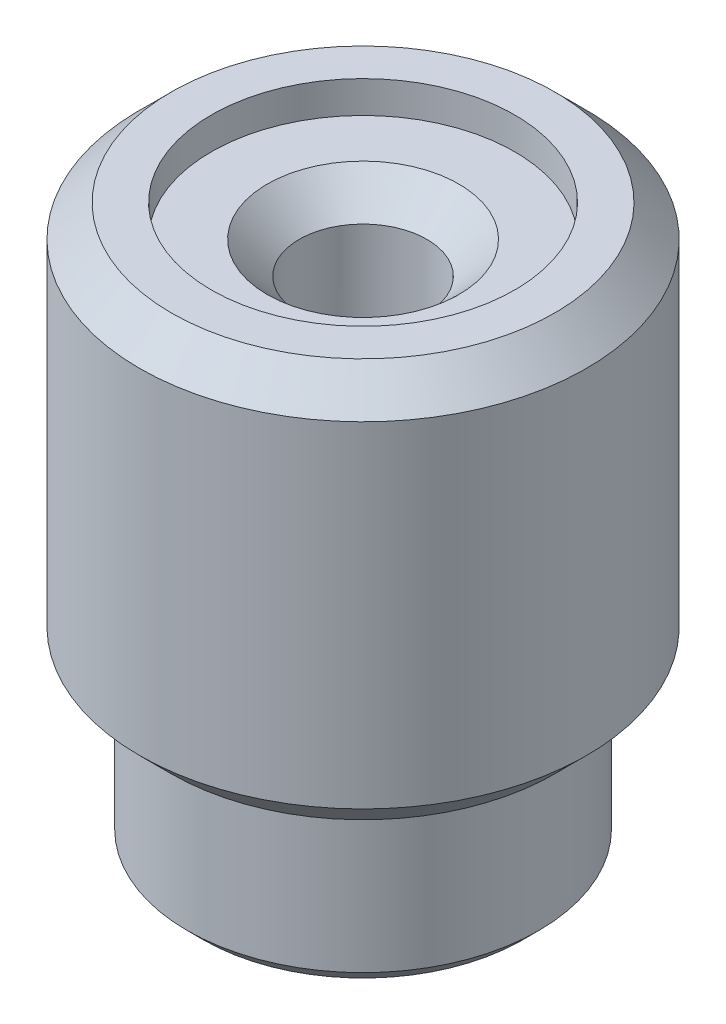
ISO-10303-21;
HEADER;
FILE_DESCRIPTION(('STEP AP214'),'2;1');
FILE_NAME('part.step','',(''),(''),'','','');
FILE_SCHEMA(('AUTOMOTIVE_DESIGN { 1 0 10303 214 1 1 1 1 }'));
ENDSEC;
DATA;
#1=APPLICATION_CONTEXT('core data for automotive mechanical design processes');
#2=APPLICATION_PROTOCOL_DEFINITION('international standard','automotive_design',2000,#1);
#3=PRODUCT_CONTEXT('',#1,'mechanical');
#4=PRODUCT('Part','Part','',(#3));
#5=PRODUCT_RELATED_PRODUCT_CATEGORY('part','',(#4));
#6=PRODUCT_DEFINITION_FORMATION('','',#4);
#7=PRODUCT_DEFINITION_CONTEXT('part definition',#1,'design');
#8=PRODUCT_DEFINITION('design','',#6,#7);
#9=PRODUCT_DEFINITION_SHAPE('','',#8);
#10=(LENGTH_UNIT() NAMED_UNIT(*) SI_UNIT(.MILLI.,.METRE.));
#11=(NAMED_UNIT(*) PLANE_ANGLE_UNIT() SI_UNIT($,.RADIAN.));
#12=(NAMED_UNIT(*) SI_UNIT($,.STERADIAN.) SOLID_ANGLE_UNIT());
#13=UNCERTAINTY_MEASURE_WITH_UNIT(LENGTH_MEASURE(1.E-05),#10,'distance_accuracy_value','');
#14=(GEOMETRIC_REPRESENTATION_CONTEXT(3) GLOBAL_UNCERTAINTY_ASSIGNED_CONTEXT((#13)) GLOBAL_UNIT_ASSIGNED_CONTEXT((#10,
#11,#12)) REPRESENTATION_CONTEXT('',''));
#15=CARTESIAN_POINT('',(0.,0.,0.));
#16=DIRECTION('',(0.,0.,1.));
#17=DIRECTION('',(1.,0.,0.));
#18=AXIS2_PLACEMENT_3D('',#15,#16,#17);
#19=CARTESIAN_POINT('',(-1.71440701370784,-10.7941606488242,5.21819525465617));
#20=DIRECTION('',(0.,1.,0.));
#21=DIRECTION('',(0.,0.,1.));
#22=AXIS2_PLACEMENT_3D('',#19,#20,#21);
#23=CYLINDRICAL_SURFACE('',#22,1.016);
#24=CARTESIAN_POINT('',(-1.71440701370784,-2.92016064882418,5.21819525465617));
#25=DIRECTION('',(0.,1.,0.));
#26=DIRECTION('',(0.,0.,1.));
#27=AXIS2_PLACEMENT_3D('',#24,#25,#26);
#28=CIRCLE('',#27,1.016);
#29=CARTESIAN_POINT('',(-1.71440701370784,-2.92016064882418,6.23419525465617));
#30=VERTEX_POINT('',#29);
#31=EDGE_CURVE('E46',#30,#30,#28,.T.);
#32=ORIENTED_EDGE('',*,*,#31,.T.);
#33=EDGE_LOOP('',(#32));
#34=FACE_BOUND('',#33,.T.);
#35=CARTESIAN_POINT('',(-1.71440701370784,-5.71416064882418,5.21819525465617));
#36=DIRECTION('',(0.,-1.,0.));
#37=DIRECTION('',(0.,0.,-1.));
#38=AXIS2_PLACEMENT_3D('',#35,#36,#37);
#39=CIRCLE('',#38,1.016);
#40=CARTESIAN_POINT('',(-1.71440701370784,-5.71416064882418,4.20219525465617));
#41=VERTEX_POINT('',#40);
#42=EDGE_CURVE('E53',#41,#41,#39,.F.);
#43=ORIENTED_EDGE('',*,*,#42,.F.);
#44=EDGE_LOOP('',(#43));
#45=FACE_BOUND('',#44,.T.);
#46=ADVANCED_FACE('F14',(#34,#45),#23,.F.);
#47=CARTESIAN_POINT('',(-1.71440701370784,-8.25416064882418,5.21819525465617));
#48=DIRECTION('',(0.,-1.,0.));
#49=DIRECTION('',(0.,0.,-1.));
#50=AXIS2_PLACEMENT_3D('',#47,#48,#49);
#51=CYLINDRICAL_SURFACE('',#50,2.794);
#52=CARTESIAN_POINT('',(-1.71440701370784,-10.5401606488242,5.21819525465617));
#53=DIRECTION('',(0.,1.,0.));
#54=DIRECTION('',(0.,0.,1.));
#55=AXIS2_PLACEMENT_3D('',#52,#53,#54);
#56=CIRCLE('',#55,2.794);
#57=CARTESIAN_POINT('',(-1.71440701370784,-10.5401606488242,8.01219525465617));
#58=VERTEX_POINT('',#57);
#59=EDGE_CURVE('E9',#58,#58,#56,.T.);
#60=ORIENTED_EDGE('',*,*,#59,.T.);
#61=EDGE_LOOP('',(#60));
#62=FACE_BOUND('',#61,.T.);
#63=CARTESIAN_POINT('',(-1.71440701370784,-8.25416064882418,5.21819525465617));
#64=DIRECTION('',(0.,1.,0.));
#65=DIRECTION('',(0.,0.,1.));
#66=AXIS2_PLACEMENT_3D('',#63,#64,#65);
#67=CIRCLE('',#66,2.794);
#68=CARTESIAN_POINT('',(-1.71440701370784,-8.25416064882418,8.01219525465617));
#69=VERTEX_POINT('',#68);
#70=EDGE_CURVE('E52',#69,#69,#67,.T.);
#71=ORIENTED_EDGE('',*,*,#70,.F.);
#72=EDGE_LOOP('',(#71));
#73=FACE_BOUND('',#72,.T.);
#74=ADVANCED_FACE('F91',(#62,#73),#51,.T.);
#75=CARTESIAN_POINT('',(-1.71440701370784,-10.7941606488242,5.21819525465617));
#76=DIRECTION('',(0.,1.,0.));
#77=DIRECTION('',(0.,0.,1.));
#78=AXIS2_PLACEMENT_3D('',#75,#76,#77);
#79=PLANE('',#78);
#80=CARTESIAN_POINT('',(-1.71440701370784,-10.7941606488242,5.21819525465617));
#81=DIRECTION('',(0.,1.,0.));
#82=DIRECTION('',(0.,0.,1.));
#83=AXIS2_PLACEMENT_3D('',#80,#81,#82);
#84=CIRCLE('',#83,1.7526);
#85=CARTESIAN_POINT('',(-1.71440701370784,-10.7941606488242,6.97079525465616));
#86=VERTEX_POINT('',#85);
#87=EDGE_CURVE('E22',#86,#86,#84,.T.);
#88=ORIENTED_EDGE('',*,*,#87,.T.);
#89=EDGE_LOOP('',(#88));
#90=FACE_BOUND('',#89,.T.);
#91=CARTESIAN_POINT('',(-1.71440701370784,-10.7941606488242,5.21819525465617));
#92=DIRECTION('',(0.,1.,0.));
#93=DIRECTION('',(0.,0.,1.));
#94=AXIS2_PLACEMENT_3D('',#91,#92,#93);
#95=CIRCLE('',#94,2.54);
#96=CARTESIAN_POINT('',(-1.71440701370784,-10.7941606488242,7.75819525465617));
#97=VERTEX_POINT('',#96);
#98=EDGE_CURVE('E26',#97,#97,#95,.F.);
#99=ORIENTED_EDGE('',*,*,#98,.T.);
#100=EDGE_LOOP('',(#99));
#101=FACE_BOUND('',#100,.T.);
#102=ADVANCED_FACE('F97',(#90,#101),#79,.F.);
#103=CARTESIAN_POINT('',(-1.71440701370784,-8.25416064882418,5.21819525465617));
#104=DIRECTION('',(0.,1.,0.));
#105=DIRECTION('',(0.,0.,1.));
#106=AXIS2_PLACEMENT_3D('',#103,#104,#105);
#107=PLANE('',#106);
#108=CARTESIAN_POINT('',(-1.71440701370784,-8.25416064882418,5.21819525465617));
#109=DIRECTION('',(0.,1.,0.));
#110=DIRECTION('',(0.,0.,1.));
#111=AXIS2_PLACEMENT_3D('',#108,#109,#110);
#112=CIRCLE('',#111,3.048);
#113=CARTESIAN_POINT('',(-1.71440701370784,-8.25416064882418,8.26619525465617));
#114=VERTEX_POINT('',#113);
#115=EDGE_CURVE('E37',#114,#114,#112,.F.);
#116=ORIENTED_EDGE('',*,*,#115,.T.);
#117=EDGE_LOOP('',(#116));
#118=FACE_BOUND('',#117,.T.);
#119=ORIENTED_EDGE('',*,*,#70,.T.);
#120=EDGE_LOOP('',(#119));
#121=FACE_BOUND('',#120,.T.);
#122=ADVANCED_FACE('F110',(#118,#121),#107,.F.);
#123=CARTESIAN_POINT('',(-1.71440701370784,-1.90416064882418,5.21819525465617));
#124=DIRECTION('',(0.,-1.,0.));
#125=DIRECTION('',(0.,0.,-1.));
#126=AXIS2_PLACEMENT_3D('',#123,#124,#125);
#127=CYLINDRICAL_SURFACE('',#126,3.556);
#128=CARTESIAN_POINT('',(-1.71440701370784,-7.74616064882419,5.21819525465617));
#129=DIRECTION('',(0.,1.,0.));
#130=DIRECTION('',(0.,0.,1.));
#131=AXIS2_PLACEMENT_3D('',#128,#129,#130);
#132=CIRCLE('',#131,3.556);
#133=CARTESIAN_POINT('',(-1.71440701370784,-7.74616064882419,8.77419525465617));
#134=VERTEX_POINT('',#133);
#135=EDGE_CURVE('E40',#134,#134,#132,.T.);
#136=ORIENTED_EDGE('',*,*,#135,.T.);
#137=EDGE_LOOP('',(#136));
#138=FACE_BOUND('',#137,.T.);
#139=CARTESIAN_POINT('',(-1.71440701370784,-2.41216064882418,5.21819525465617));
#140=DIRECTION('',(0.,1.,0.));
#141=DIRECTION('',(0.,0.,1.));
#142=AXIS2_PLACEMENT_3D('',#139,#140,#141);
#143=CIRCLE('',#142,3.556);
#144=CARTESIAN_POINT('',(-1.71440701370784,-2.41216064882418,8.77419525465617));
#145=VERTEX_POINT('',#144);
#146=EDGE_CURVE('E43',#145,#145,#143,.F.);
#147=ORIENTED_EDGE('',*,*,#146,.T.);
#148=EDGE_LOOP('',(#147));
#149=FACE_BOUND('',#148,.T.);
#150=ADVANCED_FACE('F108',(#138,#149),#127,.T.);
#151=CARTESIAN_POINT('',(-1.71440701370784,-1.90416064882418,5.21819525465617));
#152=DIRECTION('',(0.,1.,0.));
#153=DIRECTION('',(0.,0.,1.));
#154=AXIS2_PLACEMENT_3D('',#151,#152,#153);
#155=PLANE('',#154);
#156=CARTESIAN_POINT('',(-1.71440701370784,-1.90416064882418,5.21819525465617));
#157=DIRECTION('',(0.,1.,0.));
#158=DIRECTION('',(0.,0.,1.));
#159=AXIS2_PLACEMENT_3D('',#156,#157,#158);
#160=CIRCLE('',#159,3.048);
#161=CARTESIAN_POINT('',(-1.71440701370784,-1.90416064882418,8.26619525465617));
#162=VERTEX_POINT('',#161);
#163=EDGE_CURVE('E34',#162,#162,#160,.T.);
#164=ORIENTED_EDGE('',*,*,#163,.T.);
#165=EDGE_LOOP('',(#164));
#166=FACE_BOUND('',#165,.T.);
#167=CARTESIAN_POINT('',(-1.71440701370784,-1.90416064882418,5.21819525465617));
#168=DIRECTION('',(0.,1.,0.));
#169=DIRECTION('',(0.,0.,1.));
#170=AXIS2_PLACEMENT_3D('',#167,#168,#169);
#171=CIRCLE('',#170,2.413);
#172=CARTESIAN_POINT('',(-1.71440701370784,-1.90416064882418,7.63119525465617));
#173=VERTEX_POINT('',#172);
#174=EDGE_CURVE('E56',#173,#173,#171,.T.);
#175=ORIENTED_EDGE('',*,*,#174,.F.);
#176=EDGE_LOOP('',(#175));
#177=FACE_BOUND('',#176,.T.);
#178=ADVANCED_FACE('F104',(#166,#177),#155,.T.);
#179=CARTESIAN_POINT('',(-1.71440701370784,-2.41216064882418,5.21819525465617));
#180=DIRECTION('',(0.,1.,0.));
#181=DIRECTION('',(0.,0.,1.));
#182=AXIS2_PLACEMENT_3D('',#179,#180,#181);
#183=PLANE('',#182);
#184=CARTESIAN_POINT('',(-1.71440701370784,-2.41216064882418,5.21819525465617));
#185=DIRECTION('',(0.,1.,0.));
#186=DIRECTION('',(0.,0.,1.));
#187=AXIS2_PLACEMENT_3D('',#184,#185,#186);
#188=CIRCLE('',#187,1.52399999999999);
#189=CARTESIAN_POINT('',(-1.71440701370784,-2.41216064882418,6.74219525465616));
#190=VERTEX_POINT('',#189);
#191=EDGE_CURVE('E49',#190,#190,#188,.F.);
#192=ORIENTED_EDGE('',*,*,#191,.T.);
#193=EDGE_LOOP('',(#192));
#194=FACE_BOUND('',#193,.T.);
#195=CARTESIAN_POINT('',(-1.71440701370784,-2.41216064882418,5.21819525465617));
#196=DIRECTION('',(0.,1.,0.));
#197=DIRECTION('',(0.,0.,1.));
#198=AXIS2_PLACEMENT_3D('',#195,#196,#197);
#199=CIRCLE('',#198,2.413);
#200=CARTESIAN_POINT('',(-1.71440701370784,-2.41216064882418,7.63119525465617));
#201=VERTEX_POINT('',#200);
#202=EDGE_CURVE('E59',#201,#201,#199,.T.);
#203=ORIENTED_EDGE('',*,*,#202,.T.);
#204=EDGE_LOOP('',(#203));
#205=FACE_BOUND('',#204,.T.);
#206=ADVANCED_FACE('F107',(#194,#205),#183,.T.);
#207=CARTESIAN_POINT('',(-1.71440701370784,-2.41216064882418,5.21819525465617));
#208=DIRECTION('',(0.,1.,0.));
#209=DIRECTION('',(0.,0.,1.));
#210=AXIS2_PLACEMENT_3D('',#207,#208,#209);
#211=CYLINDRICAL_SURFACE('',#210,2.413);
#212=ORIENTED_EDGE('',*,*,#202,.F.);
#213=EDGE_LOOP('',(#212));
#214=FACE_BOUND('',#213,.T.);
#215=ORIENTED_EDGE('',*,*,#174,.T.);
#216=EDGE_LOOP('',(#215));
#217=FACE_BOUND('',#216,.T.);
#218=ADVANCED_FACE('F102',(#214,#217),#211,.F.);
#219=CARTESIAN_POINT('',(-1.71440701370784,-5.71416064882418,5.21819525465617));
#220=DIRECTION('',(0.,-1.,0.));
#221=DIRECTION('',(0.,0.,-1.));
#222=AXIS2_PLACEMENT_3D('',#219,#220,#221);
#223=PLANE('',#222);
#224=ORIENTED_EDGE('',*,*,#42,.T.);
#225=EDGE_LOOP('',(#224));
#226=FACE_BOUND('',#225,.T.);
#227=CARTESIAN_POINT('',(-1.71440701370784,-5.71416064882418,5.21819525465617));
#228=DIRECTION('',(0.,-1.,0.));
#229=DIRECTION('',(0.,0.,-1.));
#230=AXIS2_PLACEMENT_3D('',#227,#228,#229);
#231=CIRCLE('',#230,1.6764);
#232=CARTESIAN_POINT('',(-1.71440701370784,-5.71416064882418,3.54179525465617));
#233=VERTEX_POINT('',#232);
#234=EDGE_CURVE('E64',#233,#233,#231,.T.);
#235=ORIENTED_EDGE('',*,*,#234,.T.);
#236=EDGE_LOOP('',(#235));
#237=FACE_BOUND('',#236,.T.);
#238=ADVANCED_FACE('F139',(#226,#237),#223,.T.);
#239=CARTESIAN_POINT('',(-1.71440701370784,-5.71416064882418,5.21819525465617));
#240=DIRECTION('',(0.,-1.,0.));
#241=DIRECTION('',(0.,0.,-1.));
#242=AXIS2_PLACEMENT_3D('',#239,#240,#241);
#243=CYLINDRICAL_SURFACE('',#242,1.4986);
#244=CARTESIAN_POINT('',(-1.71440701370784,-6.22216064882418,5.21819525465617));
#245=DIRECTION('',(0.,-1.,0.));
#246=DIRECTION('',(0.,0.,-1.));
#247=AXIS2_PLACEMENT_3D('',#244,#245,#246);
#248=CIRCLE('',#247,1.4986);
#249=CARTESIAN_POINT('',(-1.71440701370784,-6.22216064882418,3.71959525465617));
#250=VERTEX_POINT('',#249);
#251=EDGE_CURVE('E18',#250,#250,#248,.F.);
#252=ORIENTED_EDGE('',*,*,#251,.T.);
#253=EDGE_LOOP('',(#252));
#254=FACE_BOUND('',#253,.T.);
#255=CARTESIAN_POINT('',(-1.71440701370784,-10.5401606488242,5.21819525465617));
#256=DIRECTION('',(0.,1.,0.));
#257=DIRECTION('',(0.,0.,1.));
#258=AXIS2_PLACEMENT_3D('',#255,#256,#257);
#259=CIRCLE('',#258,1.4986);
#260=CARTESIAN_POINT('',(-1.71440701370784,-10.5401606488242,6.71679525465617));
#261=VERTEX_POINT('',#260);
#262=EDGE_CURVE('E31',#261,#261,#259,.F.);
#263=ORIENTED_EDGE('',*,*,#262,.T.);
#264=EDGE_LOOP('',(#263));
#265=FACE_BOUND('',#264,.T.);
#266=ADVANCED_FACE('F74',(#254,#265),#243,.F.);
#267=CARTESIAN_POINT('',(-1.71440701370784,-2.41216064882418,5.21819525465617));
#268=DIRECTION('',(0.,1.,0.));
#269=DIRECTION('',(0.,0.,1.));
#270=AXIS2_PLACEMENT_3D('',#267,#268,#269);
#271=CONICAL_SURFACE('',#270,1.52399999999999,0.785398163397443);
#272=ORIENTED_EDGE('',*,*,#31,.F.);
#273=EDGE_LOOP('',(#272));
#274=FACE_BOUND('',#273,.T.);
#275=ORIENTED_EDGE('',*,*,#191,.F.);
#276=EDGE_LOOP('',(#275));
#277=FACE_BOUND('',#276,.T.);
#278=ADVANCED_FACE('F120',(#274,#277),#271,.F.);
#279=CARTESIAN_POINT('',(-1.71440701370784,-7.74616064882419,5.21819525465617));
#280=DIRECTION('',(0.,1.,0.));
#281=DIRECTION('',(0.,0.,1.));
#282=AXIS2_PLACEMENT_3D('',#279,#280,#281);
#283=CONICAL_SURFACE('',#282,3.556,0.78539816339745);
#284=ORIENTED_EDGE('',*,*,#115,.F.);
#285=EDGE_LOOP('',(#284));
#286=FACE_BOUND('',#285,.T.);
#287=ORIENTED_EDGE('',*,*,#135,.F.);
#288=EDGE_LOOP('',(#287));
#289=FACE_BOUND('',#288,.T.);
#290=ADVANCED_FACE('F123',(#286,#289),#283,.T.);
#291=CARTESIAN_POINT('',(-1.71440701370784,-1.90416064882418,5.21819525465617));
#292=DIRECTION('',(0.,-1.,0.));
#293=DIRECTION('',(0.,0.,-1.));
#294=AXIS2_PLACEMENT_3D('',#291,#292,#293);
#295=CONICAL_SURFACE('',#294,3.048,0.785398163397447);
#296=ORIENTED_EDGE('',*,*,#146,.F.);
#297=EDGE_LOOP('',(#296));
#298=FACE_BOUND('',#297,.T.);
#299=ORIENTED_EDGE('',*,*,#163,.F.);
#300=EDGE_LOOP('',(#299));
#301=FACE_BOUND('',#300,.T.);
#302=ADVANCED_FACE('F127',(#298,#301),#295,.T.);
#303=CARTESIAN_POINT('',(-1.71440701370784,-10.5401606488242,5.21819525465617));
#304=DIRECTION('',(0.,-1.,0.));
#305=DIRECTION('',(0.,0.,-1.));
#306=AXIS2_PLACEMENT_3D('',#303,#304,#305);
#307=CONICAL_SURFACE('',#306,1.4986,0.785398163397449);
#308=ORIENTED_EDGE('',*,*,#87,.F.);
#309=EDGE_LOOP('',(#308));
#310=FACE_BOUND('',#309,.T.);
#311=ORIENTED_EDGE('',*,*,#262,.F.);
#312=EDGE_LOOP('',(#311));
#313=FACE_BOUND('',#312,.T.);
#314=ADVANCED_FACE('F88',(#310,#313),#307,.F.);
#315=CARTESIAN_POINT('',(-1.71440701370784,-10.5401606488242,5.21819525465617));
#316=DIRECTION('',(0.,1.,0.));
#317=DIRECTION('',(0.,0.,1.));
#318=AXIS2_PLACEMENT_3D('',#315,#316,#317);
#319=CONICAL_SURFACE('',#318,2.794,0.785398163397449);
#320=ORIENTED_EDGE('',*,*,#98,.F.);
#321=EDGE_LOOP('',(#320));
#322=FACE_BOUND('',#321,.T.);
#323=ORIENTED_EDGE('',*,*,#59,.F.);
#324=EDGE_LOOP('',(#323));
#325=FACE_BOUND('',#324,.T.);
#326=ADVANCED_FACE('F16',(#322,#325),#319,.T.);
#327=CARTESIAN_POINT('',(-1.71440701370784,-6.22216064882418,5.21819525465617));
#328=DIRECTION('',(0.,-1.,0.));
#329=DIRECTION('',(0.,0.,-1.));
#330=AXIS2_PLACEMENT_3D('',#327,#328,#329);
#331=PLANE('',#330);
#332=CARTESIAN_POINT('',(-1.71440701370784,-6.22216064882418,5.21819525465617));
#333=DIRECTION('',(0.,-1.,0.));
#334=DIRECTION('',(0.,0.,-1.));
#335=AXIS2_PLACEMENT_3D('',#332,#333,#334);
#336=CIRCLE('',#335,1.6764);
#337=CARTESIAN_POINT('',(-1.71440701370784,-6.22216064882418,3.54179525465617));
#338=VERTEX_POINT('',#337);
#339=EDGE_CURVE('E67',#338,#338,#336,.T.);
#340=ORIENTED_EDGE('',*,*,#339,.F.);
#341=EDGE_LOOP('',(#340));
#342=FACE_BOUND('',#341,.T.);
#343=ORIENTED_EDGE('',*,*,#251,.F.);
#344=EDGE_LOOP('',(#343));
#345=FACE_BOUND('',#344,.T.);
#346=ADVANCED_FACE('F77',(#342,#345),#331,.F.);
#347=CARTESIAN_POINT('',(-1.71440701370784,-6.22216064882418,5.21819525465617));
#348=DIRECTION('',(0.,1.,0.));
#349=DIRECTION('',(0.,0.,1.));
#350=AXIS2_PLACEMENT_3D('',#347,#348,#349);
#351=CYLINDRICAL_SURFACE('',#350,1.6764);
#352=ORIENTED_EDGE('',*,*,#339,.T.);
#353=EDGE_LOOP('',(#352));
#354=FACE_BOUND('',#353,.T.);
#355=ORIENTED_EDGE('',*,*,#234,.F.);
#356=EDGE_LOOP('',(#355));
#357=FACE_BOUND('',#356,.T.);
#358=ADVANCED_FACE('F79',(#354,#357),#351,.F.);
#359=CLOSED_SHELL('',(#46,#74,#102,#122,#150,#178,#206,#218,#238,#266,#278,#290,#302,#314,#326,
#346,#358));
#360=MANIFOLD_SOLID_BREP('B1',#359);
#361=ADVANCED_BREP_SHAPE_REPRESENTATION('',(#18,#360),#14);
#362=SHAPE_DEFINITION_REPRESENTATION(#9,#361);
ENDSEC;
END-ISO-10303-21;
